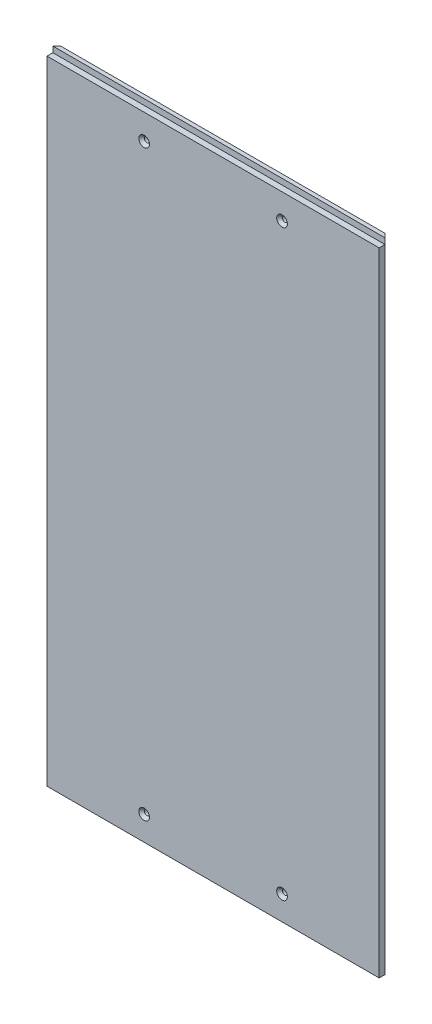
ISO-10303-21;
HEADER;
FILE_DESCRIPTION(('STEP AP214'),'2;1');
FILE_NAME('part.step','',(''),(''),'','','');
FILE_SCHEMA(('AUTOMOTIVE_DESIGN { 1 0 10303 214 1 1 1 1 }'));
ENDSEC;
DATA;
#1=APPLICATION_CONTEXT('core data for automotive mechanical design processes');
#2=APPLICATION_PROTOCOL_DEFINITION('international standard','automotive_design',2000,#1);
#3=PRODUCT_CONTEXT('',#1,'mechanical');
#4=PRODUCT('Part','Part','',(#3));
#5=PRODUCT_RELATED_PRODUCT_CATEGORY('part','',(#4));
#6=PRODUCT_DEFINITION_FORMATION('','',#4);
#7=PRODUCT_DEFINITION_CONTEXT('part definition',#1,'design');
#8=PRODUCT_DEFINITION('design','',#6,#7);
#9=PRODUCT_DEFINITION_SHAPE('','',#8);
#10=(LENGTH_UNIT() NAMED_UNIT(*) SI_UNIT(.MILLI.,.METRE.));
#11=(NAMED_UNIT(*) PLANE_ANGLE_UNIT() SI_UNIT($,.RADIAN.));
#12=(NAMED_UNIT(*) SI_UNIT($,.STERADIAN.) SOLID_ANGLE_UNIT());
#13=UNCERTAINTY_MEASURE_WITH_UNIT(LENGTH_MEASURE(1.E-05),#10,'distance_accuracy_value','');
#14=(GEOMETRIC_REPRESENTATION_CONTEXT(3) GLOBAL_UNCERTAINTY_ASSIGNED_CONTEXT((#13)) GLOBAL_UNIT_ASSIGNED_CONTEXT((#10,
#11,#12)) REPRESENTATION_CONTEXT('',''));
#15=CARTESIAN_POINT('',(0.,0.,0.));
#16=DIRECTION('',(0.,0.,1.));
#17=DIRECTION('',(1.,0.,0.));
#18=AXIS2_PLACEMENT_3D('',#15,#16,#17);
#19=CARTESIAN_POINT('',(-171.,328.5,12.));
#20=DIRECTION('',(0.,-1.,0.));
#21=DIRECTION('',(0.,0.,-1.));
#22=AXIS2_PLACEMENT_3D('',#19,#20,#21);
#23=PLANE('',#22);
#24=DIRECTION('',(1.,0.,0.));
#25=VECTOR('',#24,1.);
#26=CARTESIAN_POINT('',(-171.,328.5,2.));
#27=LINE('',#26,#25);
#28=CARTESIAN_POINT('',(-167.,328.5,2.));
#29=VERTEX_POINT('',#28);
#30=CARTESIAN_POINT('',(167.,328.5,2.));
#31=VERTEX_POINT('',#30);
#32=EDGE_CURVE('E163',#29,#31,#27,.T.);
#33=ORIENTED_EDGE('',*,*,#32,.F.);
#34=DIRECTION('',(-0.707106781186548,0.,0.707106781186548));
#35=VECTOR('',#34,1.);
#36=CARTESIAN_POINT('',(-171.,328.5,6.00000000000001));
#37=LINE('',#36,#35);
#38=CARTESIAN_POINT('',(-171.,328.5,6.));
#39=VERTEX_POINT('',#38);
#40=EDGE_CURVE('E241',#29,#39,#37,.T.);
#41=ORIENTED_EDGE('',*,*,#40,.T.);
#42=DIRECTION('',(-1.,0.,0.));
#43=VECTOR('',#42,1.);
#44=CARTESIAN_POINT('',(171.,328.5,6.));
#45=LINE('',#44,#43);
#46=CARTESIAN_POINT('',(171.,328.5,6.));
#47=VERTEX_POINT('',#46);
#48=EDGE_CURVE('E212',#47,#39,#45,.T.);
#49=ORIENTED_EDGE('',*,*,#48,.F.);
#50=DIRECTION('',(-0.707106781186548,0.,-0.707106781186548));
#51=VECTOR('',#50,1.);
#52=CARTESIAN_POINT('',(171.,328.5,6.00000000000001));
#53=LINE('',#52,#51);
#54=EDGE_CURVE('E132',#47,#31,#53,.T.);
#55=ORIENTED_EDGE('',*,*,#54,.T.);
#56=EDGE_LOOP('',(#33,#41,#49,#55));
#57=FACE_BOUND('',#56,.T.);
#58=ADVANCED_FACE('F34',(#57),#23,.F.);
#59=CARTESIAN_POINT('',(-71.,296.5,12.));
#60=DIRECTION('',(0.,0.,-1.));
#61=DIRECTION('',(-1.,0.,0.));
#62=AXIS2_PLACEMENT_3D('',#59,#60,#61);
#63=CYLINDRICAL_SURFACE('',#62,2.60000000000001);
#64=CARTESIAN_POINT('',(-71.,296.5,9.09999999999997));
#65=DIRECTION('',(0.,0.,-1.));
#66=DIRECTION('',(-1.,0.,0.));
#67=AXIS2_PLACEMENT_3D('',#64,#65,#66);
#68=CIRCLE('',#67,2.60000000000001);
#69=CARTESIAN_POINT('',(-73.6,296.5,9.09999999999997));
#70=VERTEX_POINT('',#69);
#71=EDGE_CURVE('E42',#70,#70,#68,.F.);
#72=ORIENTED_EDGE('',*,*,#71,.T.);
#73=EDGE_LOOP('',(#72));
#74=FACE_BOUND('',#73,.T.);
#75=CARTESIAN_POINT('',(-71.,296.5,2.));
#76=DIRECTION('',(0.,0.,-1.));
#77=DIRECTION('',(-1.,0.,0.));
#78=AXIS2_PLACEMENT_3D('',#75,#76,#77);
#79=CIRCLE('',#78,2.60000000000001);
#80=CARTESIAN_POINT('',(-73.6,296.5,2.));
#81=VERTEX_POINT('',#80);
#82=EDGE_CURVE('E181',#81,#81,#79,.F.);
#83=ORIENTED_EDGE('',*,*,#82,.F.);
#84=EDGE_LOOP('',(#83));
#85=FACE_BOUND('',#84,.T.);
#86=ADVANCED_FACE('F258',(#74,#85),#63,.F.);
#87=CARTESIAN_POINT('',(71.,296.5,12.));
#88=DIRECTION('',(0.,0.,-1.));
#89=DIRECTION('',(-1.,0.,0.));
#90=AXIS2_PLACEMENT_3D('',#87,#88,#89);
#91=CYLINDRICAL_SURFACE('',#90,2.60000000000001);
#92=CARTESIAN_POINT('',(71.,296.5,9.09999999999997));
#93=DIRECTION('',(0.,0.,-1.));
#94=DIRECTION('',(-1.,0.,0.));
#95=AXIS2_PLACEMENT_3D('',#92,#93,#94);
#96=CIRCLE('',#95,2.60000000000001);
#97=CARTESIAN_POINT('',(68.4,296.5,9.09999999999997));
#98=VERTEX_POINT('',#97);
#99=EDGE_CURVE('E156',#98,#98,#96,.F.);
#100=ORIENTED_EDGE('',*,*,#99,.T.);
#101=EDGE_LOOP('',(#100));
#102=FACE_BOUND('',#101,.T.);
#103=CARTESIAN_POINT('',(71.,296.5,2.));
#104=DIRECTION('',(0.,0.,-1.));
#105=DIRECTION('',(-1.,0.,0.));
#106=AXIS2_PLACEMENT_3D('',#103,#104,#105);
#107=CIRCLE('',#106,2.60000000000001);
#108=CARTESIAN_POINT('',(68.4,296.5,2.));
#109=VERTEX_POINT('',#108);
#110=EDGE_CURVE('E178',#109,#109,#107,.F.);
#111=ORIENTED_EDGE('',*,*,#110,.F.);
#112=EDGE_LOOP('',(#111));
#113=FACE_BOUND('',#112,.T.);
#114=ADVANCED_FACE('F260',(#102,#113),#91,.F.);
#115=CARTESIAN_POINT('',(171.,-328.5,12.));
#116=DIRECTION('',(-1.,0.,0.));
#117=DIRECTION('',(0.,0.,1.));
#118=AXIS2_PLACEMENT_3D('',#115,#116,#117);
#119=PLANE('',#118);
#120=DIRECTION('',(0.,0.,-1.));
#121=VECTOR('',#120,1.);
#122=CARTESIAN_POINT('',(171.,-328.5,12.));
#123=LINE('',#122,#121);
#124=CARTESIAN_POINT('',(171.,-328.5,12.));
#125=VERTEX_POINT('',#124);
#126=CARTESIAN_POINT('',(171.,-328.5,6.00000000000001));
#127=VERTEX_POINT('',#126);
#128=EDGE_CURVE('E232',#125,#127,#123,.T.);
#129=ORIENTED_EDGE('',*,*,#128,.T.);
#130=DIRECTION('',(0.,1.,0.));
#131=VECTOR('',#130,1.);
#132=CARTESIAN_POINT('',(171.,328.5,6.00000000000001));
#133=LINE('',#132,#131);
#134=CARTESIAN_POINT('',(171.,322.5,6.));
#135=VERTEX_POINT('',#134);
#136=EDGE_CURVE('E238',#127,#135,#133,.T.);
#137=ORIENTED_EDGE('',*,*,#136,.T.);
#138=DIRECTION('',(0.,0.,1.));
#139=VECTOR('',#138,1.);
#140=CARTESIAN_POINT('',(171.,322.5,12.));
#141=LINE('',#140,#139);
#142=CARTESIAN_POINT('',(171.,322.5,12.));
#143=VERTEX_POINT('',#142);
#144=EDGE_CURVE('E208',#135,#143,#141,.T.);
#145=ORIENTED_EDGE('',*,*,#144,.T.);
#146=DIRECTION('',(0.,1.,0.));
#147=VECTOR('',#146,1.);
#148=CARTESIAN_POINT('',(171.,-328.5,12.));
#149=LINE('',#148,#147);
#150=EDGE_CURVE('E225',#125,#143,#149,.T.);
#151=ORIENTED_EDGE('',*,*,#150,.F.);
#152=EDGE_LOOP('',(#129,#137,#145,#151));
#153=FACE_BOUND('',#152,.T.);
#154=ADVANCED_FACE('F267',(#153),#119,.F.);
#155=CARTESIAN_POINT('',(-171.,-328.5,12.));
#156=DIRECTION('',(1.,0.,0.));
#157=DIRECTION('',(0.,0.,-1.));
#158=AXIS2_PLACEMENT_3D('',#155,#156,#157);
#159=PLANE('',#158);
#160=DIRECTION('',(0.,0.,1.));
#161=VECTOR('',#160,1.);
#162=CARTESIAN_POINT('',(-171.,322.5,12.));
#163=LINE('',#162,#161);
#164=CARTESIAN_POINT('',(-171.,322.5,6.));
#165=VERTEX_POINT('',#164);
#166=CARTESIAN_POINT('',(-171.,322.5,12.));
#167=VERTEX_POINT('',#166);
#168=EDGE_CURVE('E209',#165,#167,#163,.T.);
#169=ORIENTED_EDGE('',*,*,#168,.F.);
#170=DIRECTION('',(0.,-1.,0.));
#171=VECTOR('',#170,1.);
#172=CARTESIAN_POINT('',(-171.,-328.5,6.00000000000001));
#173=LINE('',#172,#171);
#174=CARTESIAN_POINT('',(-171.,-328.5,6.00000000000001));
#175=VERTEX_POINT('',#174);
#176=EDGE_CURVE('E56',#165,#175,#173,.T.);
#177=ORIENTED_EDGE('',*,*,#176,.T.);
#178=DIRECTION('',(0.,0.,-1.));
#179=VECTOR('',#178,1.);
#180=CARTESIAN_POINT('',(-171.,-328.5,12.));
#181=LINE('',#180,#179);
#182=CARTESIAN_POINT('',(-171.,-328.5,12.));
#183=VERTEX_POINT('',#182);
#184=EDGE_CURVE('E236',#183,#175,#181,.T.);
#185=ORIENTED_EDGE('',*,*,#184,.F.);
#186=DIRECTION('',(0.,-1.,0.));
#187=VECTOR('',#186,1.);
#188=CARTESIAN_POINT('',(-171.,-328.5,12.));
#189=LINE('',#188,#187);
#190=EDGE_CURVE('E228',#167,#183,#189,.T.);
#191=ORIENTED_EDGE('',*,*,#190,.F.);
#192=EDGE_LOOP('',(#169,#177,#185,#191));
#193=FACE_BOUND('',#192,.T.);
#194=ADVANCED_FACE('F300',(#193),#159,.F.);
#195=CARTESIAN_POINT('',(-171.,-328.5,12.));
#196=DIRECTION('',(0.,1.,0.));
#197=DIRECTION('',(0.,0.,1.));
#198=AXIS2_PLACEMENT_3D('',#195,#196,#197);
#199=PLANE('',#198);
#200=DIRECTION('',(1.,0.,0.));
#201=VECTOR('',#200,1.);
#202=CARTESIAN_POINT('',(-171.,-328.5,0.));
#203=LINE('',#202,#201);
#204=CARTESIAN_POINT('',(-165.,-328.5,0.));
#205=VERTEX_POINT('',#204);
#206=CARTESIAN_POINT('',(165.,-328.5,0.));
#207=VERTEX_POINT('',#206);
#208=EDGE_CURVE('E219',#205,#207,#203,.T.);
#209=ORIENTED_EDGE('',*,*,#208,.T.);
#210=DIRECTION('',(0.707106781186548,0.,0.707106781186548));
#211=VECTOR('',#210,1.);
#212=CARTESIAN_POINT('',(171.,-328.5,6.00000000000001));
#213=LINE('',#212,#211);
#214=EDGE_CURVE('E128',#207,#127,#213,.T.);
#215=ORIENTED_EDGE('',*,*,#214,.T.);
#216=ORIENTED_EDGE('',*,*,#128,.F.);
#217=DIRECTION('',(1.,0.,0.));
#218=VECTOR('',#217,1.);
#219=CARTESIAN_POINT('',(-171.,-328.5,12.));
#220=LINE('',#219,#218);
#221=EDGE_CURVE('E230',#183,#125,#220,.T.);
#222=ORIENTED_EDGE('',*,*,#221,.F.);
#223=ORIENTED_EDGE('',*,*,#184,.T.);
#224=DIRECTION('',(0.707106781186548,0.,-0.707106781186548));
#225=VECTOR('',#224,1.);
#226=CARTESIAN_POINT('',(-171.,-328.5,6.00000000000001));
#227=LINE('',#226,#225);
#228=EDGE_CURVE('E129',#175,#205,#227,.T.);
#229=ORIENTED_EDGE('',*,*,#228,.T.);
#230=EDGE_LOOP('',(#209,#215,#216,#222,#223,#229));
#231=FACE_BOUND('',#230,.T.);
#232=ADVANCED_FACE('F294',(#231),#199,.F.);
#233=CARTESIAN_POINT('',(0.,0.,12.));
#234=DIRECTION('',(0.,0.,-1.));
#235=DIRECTION('',(-1.,0.,0.));
#236=AXIS2_PLACEMENT_3D('',#233,#234,#235);
#237=PLANE('',#236);
#238=CARTESIAN_POINT('',(-71.,-303.5,12.));
#239=DIRECTION('',(0.,0.,-1.));
#240=DIRECTION('',(-1.,0.,0.));
#241=AXIS2_PLACEMENT_3D('',#238,#239,#240);
#242=CIRCLE('',#241,5.50000000000006);
#243=CARTESIAN_POINT('',(-76.5,-303.5,12.));
#244=VERTEX_POINT('',#243);
#245=EDGE_CURVE('E147',#244,#244,#242,.T.);
#246=ORIENTED_EDGE('',*,*,#245,.T.);
#247=EDGE_LOOP('',(#246));
#248=FACE_BOUND('',#247,.T.);
#249=CARTESIAN_POINT('',(71.,-303.5,12.));
#250=DIRECTION('',(0.,0.,-1.));
#251=DIRECTION('',(-1.,0.,0.));
#252=AXIS2_PLACEMENT_3D('',#249,#250,#251);
#253=CIRCLE('',#252,5.50000000000006);
#254=CARTESIAN_POINT('',(65.5,-303.5,12.));
#255=VERTEX_POINT('',#254);
#256=EDGE_CURVE('E144',#255,#255,#253,.T.);
#257=ORIENTED_EDGE('',*,*,#256,.T.);
#258=EDGE_LOOP('',(#257));
#259=FACE_BOUND('',#258,.T.);
#260=CARTESIAN_POINT('',(71.,296.5,12.));
#261=DIRECTION('',(0.,0.,-1.));
#262=DIRECTION('',(-1.,0.,0.));
#263=AXIS2_PLACEMENT_3D('',#260,#261,#262);
#264=CIRCLE('',#263,5.50000000000006);
#265=CARTESIAN_POINT('',(65.5,296.5,12.));
#266=VERTEX_POINT('',#265);
#267=EDGE_CURVE('E141',#266,#266,#264,.T.);
#268=ORIENTED_EDGE('',*,*,#267,.T.);
#269=EDGE_LOOP('',(#268));
#270=FACE_BOUND('',#269,.T.);
#271=CARTESIAN_POINT('',(-71.,296.5,12.));
#272=DIRECTION('',(0.,0.,-1.));
#273=DIRECTION('',(-1.,0.,0.));
#274=AXIS2_PLACEMENT_3D('',#271,#272,#273);
#275=CIRCLE('',#274,5.50000000000006);
#276=CARTESIAN_POINT('',(-76.5,296.5,12.));
#277=VERTEX_POINT('',#276);
#278=EDGE_CURVE('E138',#277,#277,#275,.T.);
#279=ORIENTED_EDGE('',*,*,#278,.T.);
#280=EDGE_LOOP('',(#279));
#281=FACE_BOUND('',#280,.T.);
#282=ORIENTED_EDGE('',*,*,#150,.T.);
#283=DIRECTION('',(-1.,0.,0.));
#284=VECTOR('',#283,1.);
#285=CARTESIAN_POINT('',(171.,322.5,12.));
#286=LINE('',#285,#284);
#287=EDGE_CURVE('E216',#143,#167,#286,.T.);
#288=ORIENTED_EDGE('',*,*,#287,.T.);
#289=ORIENTED_EDGE('',*,*,#190,.T.);
#290=ORIENTED_EDGE('',*,*,#221,.T.);
#291=EDGE_LOOP('',(#282,#288,#289,#290));
#292=FACE_BOUND('',#291,.T.);
#293=ADVANCED_FACE('F291',(#248,#259,#270,#281,#292),#237,.F.);
#294=CARTESIAN_POINT('',(0.,0.,0.));
#295=DIRECTION('',(0.,0.,-1.));
#296=DIRECTION('',(-1.,0.,0.));
#297=AXIS2_PLACEMENT_3D('',#294,#295,#296);
#298=PLANE('',#297);
#299=DIRECTION('',(-1.,0.,0.));
#300=VECTOR('',#299,1.);
#301=CARTESIAN_POINT('',(171.,280.5,0.));
#302=LINE('',#301,#300);
#303=CARTESIAN_POINT('',(165.,280.5,0.));
#304=VERTEX_POINT('',#303);
#305=CARTESIAN_POINT('',(-165.,280.5,0.));
#306=VERTEX_POINT('',#305);
#307=EDGE_CURVE('E107',#304,#306,#302,.T.);
#308=ORIENTED_EDGE('',*,*,#307,.F.);
#309=DIRECTION('',(0.,-1.,0.));
#310=VECTOR('',#309,1.);
#311=CARTESIAN_POINT('',(165.,-328.5,0.));
#312=LINE('',#311,#310);
#313=EDGE_CURVE('E120',#304,#207,#312,.T.);
#314=ORIENTED_EDGE('',*,*,#313,.T.);
#315=ORIENTED_EDGE('',*,*,#208,.F.);
#316=DIRECTION('',(0.,1.,0.));
#317=VECTOR('',#316,1.);
#318=CARTESIAN_POINT('',(-165.,328.5,0.));
#319=LINE('',#318,#317);
#320=EDGE_CURVE('E123',#205,#306,#319,.T.);
#321=ORIENTED_EDGE('',*,*,#320,.T.);
#322=EDGE_LOOP('',(#308,#314,#315,#321));
#323=FACE_BOUND('',#322,.T.);
#324=CARTESIAN_POINT('',(-71.,-303.5,0.));
#325=DIRECTION('',(0.,0.,-1.));
#326=DIRECTION('',(-1.,0.,0.));
#327=AXIS2_PLACEMENT_3D('',#324,#325,#326);
#328=CIRCLE('',#327,2.60000000000001);
#329=CARTESIAN_POINT('',(-73.6,-303.5,0.));
#330=VERTEX_POINT('',#329);
#331=EDGE_CURVE('E199',#330,#330,#328,.T.);
#332=ORIENTED_EDGE('',*,*,#331,.F.);
#333=EDGE_LOOP('',(#332));
#334=FACE_BOUND('',#333,.T.);
#335=CARTESIAN_POINT('',(71.,-303.5,0.));
#336=DIRECTION('',(0.,0.,-1.));
#337=DIRECTION('',(-1.,0.,0.));
#338=AXIS2_PLACEMENT_3D('',#335,#336,#337);
#339=CIRCLE('',#338,2.60000000000001);
#340=CARTESIAN_POINT('',(68.4,-303.5,0.));
#341=VERTEX_POINT('',#340);
#342=EDGE_CURVE('E202',#341,#341,#339,.T.);
#343=ORIENTED_EDGE('',*,*,#342,.F.);
#344=EDGE_LOOP('',(#343));
#345=FACE_BOUND('',#344,.T.);
#346=ADVANCED_FACE('F117',(#323,#334,#345),#298,.T.);
#347=CARTESIAN_POINT('',(171.,322.5,12.));
#348=DIRECTION('',(0.,-1.,0.));
#349=DIRECTION('',(0.,0.,-1.));
#350=AXIS2_PLACEMENT_3D('',#347,#348,#349);
#351=PLANE('',#350);
#352=ORIENTED_EDGE('',*,*,#168,.T.);
#353=ORIENTED_EDGE('',*,*,#287,.F.);
#354=ORIENTED_EDGE('',*,*,#144,.F.);
#355=DIRECTION('',(-1.,0.,0.));
#356=VECTOR('',#355,1.);
#357=CARTESIAN_POINT('',(171.,322.5,6.));
#358=LINE('',#357,#356);
#359=EDGE_CURVE('E220',#135,#165,#358,.T.);
#360=ORIENTED_EDGE('',*,*,#359,.T.);
#361=EDGE_LOOP('',(#352,#353,#354,#360));
#362=FACE_BOUND('',#361,.T.);
#363=ADVANCED_FACE('F283',(#362),#351,.F.);
#364=CARTESIAN_POINT('',(171.,328.5,6.));
#365=DIRECTION('',(0.,0.,-1.));
#366=DIRECTION('',(0.,1.,0.));
#367=AXIS2_PLACEMENT_3D('',#364,#365,#366);
#368=PLANE('',#367);
#369=DIRECTION('',(0.,-1.,0.));
#370=VECTOR('',#369,1.);
#371=CARTESIAN_POINT('',(-171.,328.5,6.));
#372=LINE('',#371,#370);
#373=EDGE_CURVE('E205',#39,#165,#372,.T.);
#374=ORIENTED_EDGE('',*,*,#373,.T.);
#375=ORIENTED_EDGE('',*,*,#359,.F.);
#376=DIRECTION('',(0.,-1.,0.));
#377=VECTOR('',#376,1.);
#378=CARTESIAN_POINT('',(171.,328.5,6.));
#379=LINE('',#378,#377);
#380=EDGE_CURVE('E206',#47,#135,#379,.T.);
#381=ORIENTED_EDGE('',*,*,#380,.F.);
#382=ORIENTED_EDGE('',*,*,#48,.T.);
#383=EDGE_LOOP('',(#374,#375,#381,#382));
#384=FACE_BOUND('',#383,.T.);
#385=ADVANCED_FACE('F286',(#384),#368,.F.);
#386=CARTESIAN_POINT('',(171.,-328.5,6.00000000000001));
#387=DIRECTION('',(0.707106781186547,0.,-0.707106781186547));
#388=DIRECTION('',(0.,-1.,0.));
#389=AXIS2_PLACEMENT_3D('',#386,#387,#388);
#390=PLANE('',#389);
#391=DIRECTION('',(-0.707106781186548,0.,-0.707106781186548));
#392=VECTOR('',#391,1.);
#393=CARTESIAN_POINT('',(171.,280.5,6.00000000000001));
#394=LINE('',#393,#392);
#395=CARTESIAN_POINT('',(167.,280.5,2.));
#396=VERTEX_POINT('',#395);
#397=EDGE_CURVE('E104',#396,#304,#394,.T.);
#398=ORIENTED_EDGE('',*,*,#397,.F.);
#399=DIRECTION('',(0.,1.,0.));
#400=VECTOR('',#399,1.);
#401=CARTESIAN_POINT('',(167.,-328.5,2.));
#402=LINE('',#401,#400);
#403=EDGE_CURVE('E113',#396,#31,#402,.T.);
#404=ORIENTED_EDGE('',*,*,#403,.T.);
#405=ORIENTED_EDGE('',*,*,#54,.F.);
#406=ORIENTED_EDGE('',*,*,#380,.T.);
#407=ORIENTED_EDGE('',*,*,#136,.F.);
#408=ORIENTED_EDGE('',*,*,#214,.F.);
#409=ORIENTED_EDGE('',*,*,#313,.F.);
#410=EDGE_LOOP('',(#398,#404,#405,#406,#407,#408,#409));
#411=FACE_BOUND('',#410,.T.);
#412=ADVANCED_FACE('F126',(#411),#390,.T.);
#413=CARTESIAN_POINT('',(-171.,-328.5,6.00000000000001));
#414=DIRECTION('',(-0.707106781186547,0.,-0.707106781186547));
#415=DIRECTION('',(0.,1.,0.));
#416=AXIS2_PLACEMENT_3D('',#413,#414,#415);
#417=PLANE('',#416);
#418=DIRECTION('',(-0.707106781186548,0.,0.707106781186548));
#419=VECTOR('',#418,1.);
#420=CARTESIAN_POINT('',(-171.,280.5,6.00000000000001));
#421=LINE('',#420,#419);
#422=CARTESIAN_POINT('',(-167.,280.5,2.));
#423=VERTEX_POINT('',#422);
#424=EDGE_CURVE('E11',#306,#423,#421,.T.);
#425=ORIENTED_EDGE('',*,*,#424,.F.);
#426=ORIENTED_EDGE('',*,*,#320,.F.);
#427=ORIENTED_EDGE('',*,*,#228,.F.);
#428=ORIENTED_EDGE('',*,*,#176,.F.);
#429=ORIENTED_EDGE('',*,*,#373,.F.);
#430=ORIENTED_EDGE('',*,*,#40,.F.);
#431=DIRECTION('',(0.,-1.,0.));
#432=VECTOR('',#431,1.);
#433=CARTESIAN_POINT('',(-167.,-328.5,2.));
#434=LINE('',#433,#432);
#435=EDGE_CURVE('E184',#29,#423,#434,.T.);
#436=ORIENTED_EDGE('',*,*,#435,.T.);
#437=EDGE_LOOP('',(#425,#426,#427,#428,#429,#430,#436));
#438=FACE_BOUND('',#437,.T.);
#439=ADVANCED_FACE('F281',(#438),#417,.T.);
#440=CARTESIAN_POINT('',(71.,-303.5,12.));
#441=DIRECTION('',(0.,0.,-1.));
#442=DIRECTION('',(-1.,0.,0.));
#443=AXIS2_PLACEMENT_3D('',#440,#441,#442);
#444=CYLINDRICAL_SURFACE('',#443,2.60000000000001);
#445=CARTESIAN_POINT('',(71.,-303.5,9.09999999999997));
#446=DIRECTION('',(0.,0.,-1.));
#447=DIRECTION('',(-1.,0.,0.));
#448=AXIS2_PLACEMENT_3D('',#445,#446,#447);
#449=CIRCLE('',#448,2.60000000000001);
#450=CARTESIAN_POINT('',(68.4,-303.5,9.09999999999997));
#451=VERTEX_POINT('',#450);
#452=EDGE_CURVE('E153',#451,#451,#449,.F.);
#453=ORIENTED_EDGE('',*,*,#452,.T.);
#454=EDGE_LOOP('',(#453));
#455=FACE_BOUND('',#454,.T.);
#456=ORIENTED_EDGE('',*,*,#342,.T.);
#457=EDGE_LOOP('',(#456));
#458=FACE_BOUND('',#457,.T.);
#459=ADVANCED_FACE('F277',(#455,#458),#444,.F.);
#460=CARTESIAN_POINT('',(-71.,-303.5,12.));
#461=DIRECTION('',(0.,0.,-1.));
#462=DIRECTION('',(-1.,0.,0.));
#463=AXIS2_PLACEMENT_3D('',#460,#461,#462);
#464=CYLINDRICAL_SURFACE('',#463,2.60000000000001);
#465=CARTESIAN_POINT('',(-71.,-303.5,9.09999999999997));
#466=DIRECTION('',(0.,0.,-1.));
#467=DIRECTION('',(-1.,0.,0.));
#468=AXIS2_PLACEMENT_3D('',#465,#466,#467);
#469=CIRCLE('',#468,2.60000000000001);
#470=CARTESIAN_POINT('',(-73.6,-303.5,9.09999999999997));
#471=VERTEX_POINT('',#470);
#472=EDGE_CURVE('E150',#471,#471,#469,.F.);
#473=ORIENTED_EDGE('',*,*,#472,.T.);
#474=EDGE_LOOP('',(#473));
#475=FACE_BOUND('',#474,.T.);
#476=ORIENTED_EDGE('',*,*,#331,.T.);
#477=EDGE_LOOP('',(#476));
#478=FACE_BOUND('',#477,.T.);
#479=ADVANCED_FACE('F273',(#475,#478),#464,.F.);
#480=CARTESIAN_POINT('',(-71.,-303.5,12.));
#481=DIRECTION('',(0.,0.,1.));
#482=DIRECTION('',(1.,0.,0.));
#483=AXIS2_PLACEMENT_3D('',#480,#481,#482);
#484=CONICAL_SURFACE('',#483,5.50000000000006,0.785398163397451);
#485=ORIENTED_EDGE('',*,*,#472,.F.);
#486=EDGE_LOOP('',(#485));
#487=FACE_BOUND('',#486,.T.);
#488=ORIENTED_EDGE('',*,*,#245,.F.);
#489=EDGE_LOOP('',(#488));
#490=FACE_BOUND('',#489,.T.);
#491=ADVANCED_FACE('F276',(#487,#490),#484,.F.);
#492=CARTESIAN_POINT('',(71.,-303.5,12.));
#493=DIRECTION('',(0.,0.,1.));
#494=DIRECTION('',(1.,0.,0.));
#495=AXIS2_PLACEMENT_3D('',#492,#493,#494);
#496=CONICAL_SURFACE('',#495,5.50000000000006,0.785398163397451);
#497=ORIENTED_EDGE('',*,*,#452,.F.);
#498=EDGE_LOOP('',(#497));
#499=FACE_BOUND('',#498,.T.);
#500=ORIENTED_EDGE('',*,*,#256,.F.);
#501=EDGE_LOOP('',(#500));
#502=FACE_BOUND('',#501,.T.);
#503=ADVANCED_FACE('F314',(#499,#502),#496,.F.);
#504=CARTESIAN_POINT('',(71.,296.5,12.));
#505=DIRECTION('',(0.,0.,1.));
#506=DIRECTION('',(1.,0.,0.));
#507=AXIS2_PLACEMENT_3D('',#504,#505,#506);
#508=CONICAL_SURFACE('',#507,5.50000000000006,0.785398163397451);
#509=ORIENTED_EDGE('',*,*,#99,.F.);
#510=EDGE_LOOP('',(#509));
#511=FACE_BOUND('',#510,.T.);
#512=ORIENTED_EDGE('',*,*,#267,.F.);
#513=EDGE_LOOP('',(#512));
#514=FACE_BOUND('',#513,.T.);
#515=ADVANCED_FACE('F317',(#511,#514),#508,.F.);
#516=CARTESIAN_POINT('',(-71.,296.5,12.));
#517=DIRECTION('',(0.,0.,1.));
#518=DIRECTION('',(1.,0.,0.));
#519=AXIS2_PLACEMENT_3D('',#516,#517,#518);
#520=CONICAL_SURFACE('',#519,5.50000000000006,0.785398163397451);
#521=ORIENTED_EDGE('',*,*,#71,.F.);
#522=EDGE_LOOP('',(#521));
#523=FACE_BOUND('',#522,.T.);
#524=ORIENTED_EDGE('',*,*,#278,.F.);
#525=EDGE_LOOP('',(#524));
#526=FACE_BOUND('',#525,.T.);
#527=ADVANCED_FACE('F36',(#523,#526),#520,.F.);
#528=CARTESIAN_POINT('',(0.,0.,2.));
#529=DIRECTION('',(0.,0.,-1.));
#530=DIRECTION('',(-1.,0.,0.));
#531=AXIS2_PLACEMENT_3D('',#528,#529,#530);
#532=PLANE('',#531);
#533=ORIENTED_EDGE('',*,*,#110,.T.);
#534=EDGE_LOOP('',(#533));
#535=FACE_BOUND('',#534,.T.);
#536=CARTESIAN_POINT('',(51.,296.5,2.));
#537=DIRECTION('',(0.,0.,-1.));
#538=DIRECTION('',(-1.,0.,0.));
#539=AXIS2_PLACEMENT_3D('',#536,#537,#538);
#540=CIRCLE('',#539,5.99999999999999);
#541=CARTESIAN_POINT('',(45.,296.5,2.));
#542=VERTEX_POINT('',#541);
#543=EDGE_CURVE('E167',#542,#542,#540,.F.);
#544=ORIENTED_EDGE('',*,*,#543,.T.);
#545=EDGE_LOOP('',(#544));
#546=FACE_BOUND('',#545,.T.);
#547=CARTESIAN_POINT('',(-91.,296.5,2.));
#548=DIRECTION('',(0.,0.,-1.));
#549=DIRECTION('',(-1.,0.,0.));
#550=AXIS2_PLACEMENT_3D('',#547,#548,#549);
#551=CIRCLE('',#550,5.99999999999999);
#552=CARTESIAN_POINT('',(-97.,296.5,2.));
#553=VERTEX_POINT('',#552);
#554=EDGE_CURVE('E160',#553,#553,#551,.F.);
#555=ORIENTED_EDGE('',*,*,#554,.T.);
#556=EDGE_LOOP('',(#555));
#557=FACE_BOUND('',#556,.T.);
#558=DIRECTION('',(-1.,0.,0.));
#559=VECTOR('',#558,1.);
#560=CARTESIAN_POINT('',(171.,280.5,2.));
#561=LINE('',#560,#559);
#562=EDGE_CURVE('E49',#396,#423,#561,.T.);
#563=ORIENTED_EDGE('',*,*,#562,.T.);
#564=ORIENTED_EDGE('',*,*,#435,.F.);
#565=ORIENTED_EDGE('',*,*,#32,.T.);
#566=ORIENTED_EDGE('',*,*,#403,.F.);
#567=EDGE_LOOP('',(#563,#564,#565,#566));
#568=FACE_BOUND('',#567,.T.);
#569=CARTESIAN_POINT('',(-51.,296.5,2.));
#570=DIRECTION('',(0.,0.,-1.));
#571=DIRECTION('',(-1.,0.,0.));
#572=AXIS2_PLACEMENT_3D('',#569,#570,#571);
#573=CIRCLE('',#572,5.99999999999999);
#574=CARTESIAN_POINT('',(-57.,296.5,2.));
#575=VERTEX_POINT('',#574);
#576=EDGE_CURVE('E162',#575,#575,#573,.F.);
#577=ORIENTED_EDGE('',*,*,#576,.T.);
#578=EDGE_LOOP('',(#577));
#579=FACE_BOUND('',#578,.T.);
#580=CARTESIAN_POINT('',(91.,296.5,2.));
#581=DIRECTION('',(0.,0.,-1.));
#582=DIRECTION('',(-1.,0.,0.));
#583=AXIS2_PLACEMENT_3D('',#580,#581,#582);
#584=CIRCLE('',#583,5.99999999999999);
#585=CARTESIAN_POINT('',(85.,296.5,2.));
#586=VERTEX_POINT('',#585);
#587=EDGE_CURVE('E175',#586,#586,#584,.F.);
#588=ORIENTED_EDGE('',*,*,#587,.T.);
#589=EDGE_LOOP('',(#588));
#590=FACE_BOUND('',#589,.T.);
#591=ORIENTED_EDGE('',*,*,#82,.T.);
#592=EDGE_LOOP('',(#591));
#593=FACE_BOUND('',#592,.T.);
#594=ADVANCED_FACE('F247',(#535,#546,#557,#568,#579,#590,#593),#532,.T.);
#595=CARTESIAN_POINT('',(171.,280.5,2.));
#596=DIRECTION('',(0.,-1.,0.));
#597=DIRECTION('',(0.,0.,-1.));
#598=AXIS2_PLACEMENT_3D('',#595,#596,#597);
#599=PLANE('',#598);
#600=ORIENTED_EDGE('',*,*,#397,.T.);
#601=ORIENTED_EDGE('',*,*,#307,.T.);
#602=ORIENTED_EDGE('',*,*,#424,.T.);
#603=ORIENTED_EDGE('',*,*,#562,.F.);
#604=EDGE_LOOP('',(#600,#601,#602,#603));
#605=FACE_BOUND('',#604,.T.);
#606=ADVANCED_FACE('F106',(#605),#599,.F.);
#607=CARTESIAN_POINT('',(-51.,296.5,6.));
#608=DIRECTION('',(0.,0.,-1.));
#609=DIRECTION('',(-1.,0.,0.));
#610=AXIS2_PLACEMENT_3D('',#607,#608,#609);
#611=PLANE('',#610);
#612=CARTESIAN_POINT('',(-51.,296.5,6.));
#613=DIRECTION('',(0.,0.,-1.));
#614=DIRECTION('',(-1.,0.,0.));
#615=AXIS2_PLACEMENT_3D('',#612,#613,#614);
#616=CIRCLE('',#615,5.99999999999999);
#617=CARTESIAN_POINT('',(-57.,296.5,6.));
#618=VERTEX_POINT('',#617);
#619=EDGE_CURVE('E190',#618,#618,#616,.T.);
#620=ORIENTED_EDGE('',*,*,#619,.T.);
#621=EDGE_LOOP('',(#620));
#622=FACE_BOUND('',#621,.T.);
#623=ADVANCED_FACE('F382',(#622),#611,.T.);
#624=CARTESIAN_POINT('',(-51.,296.5,6.));
#625=DIRECTION('',(0.,0.,-1.));
#626=DIRECTION('',(-1.,0.,0.));
#627=AXIS2_PLACEMENT_3D('',#624,#625,#626);
#628=CYLINDRICAL_SURFACE('',#627,5.99999999999999);
#629=ORIENTED_EDGE('',*,*,#619,.F.);
#630=EDGE_LOOP('',(#629));
#631=FACE_BOUND('',#630,.T.);
#632=ORIENTED_EDGE('',*,*,#576,.F.);
#633=EDGE_LOOP('',(#632));
#634=FACE_BOUND('',#633,.T.);
#635=ADVANCED_FACE('F359',(#631,#634),#628,.F.);
#636=CARTESIAN_POINT('',(51.,296.5,6.));
#637=DIRECTION('',(0.,0.,-1.));
#638=DIRECTION('',(-1.,0.,0.));
#639=AXIS2_PLACEMENT_3D('',#636,#637,#638);
#640=PLANE('',#639);
#641=CARTESIAN_POINT('',(51.,296.5,6.));
#642=DIRECTION('',(0.,0.,-1.));
#643=DIRECTION('',(-1.,0.,0.));
#644=AXIS2_PLACEMENT_3D('',#641,#642,#643);
#645=CIRCLE('',#644,5.99999999999999);
#646=CARTESIAN_POINT('',(45.,296.5,6.));
#647=VERTEX_POINT('',#646);
#648=EDGE_CURVE('E193',#647,#647,#645,.T.);
#649=ORIENTED_EDGE('',*,*,#648,.T.);
#650=EDGE_LOOP('',(#649));
#651=FACE_BOUND('',#650,.T.);
#652=ADVANCED_FACE('F349',(#651),#640,.T.);
#653=CARTESIAN_POINT('',(51.,296.5,6.));
#654=DIRECTION('',(0.,0.,-1.));
#655=DIRECTION('',(-1.,0.,0.));
#656=AXIS2_PLACEMENT_3D('',#653,#654,#655);
#657=CYLINDRICAL_SURFACE('',#656,5.99999999999999);
#658=ORIENTED_EDGE('',*,*,#648,.F.);
#659=EDGE_LOOP('',(#658));
#660=FACE_BOUND('',#659,.T.);
#661=ORIENTED_EDGE('',*,*,#543,.F.);
#662=EDGE_LOOP('',(#661));
#663=FACE_BOUND('',#662,.T.);
#664=ADVANCED_FACE('F346',(#660,#663),#657,.F.);
#665=CARTESIAN_POINT('',(91.,296.5,6.));
#666=DIRECTION('',(0.,0.,-1.));
#667=DIRECTION('',(-1.,0.,0.));
#668=AXIS2_PLACEMENT_3D('',#665,#666,#667);
#669=PLANE('',#668);
#670=CARTESIAN_POINT('',(91.,296.5,6.));
#671=DIRECTION('',(0.,0.,-1.));
#672=DIRECTION('',(-1.,0.,0.));
#673=AXIS2_PLACEMENT_3D('',#670,#671,#672);
#674=CIRCLE('',#673,5.99999999999999);
#675=CARTESIAN_POINT('',(85.,296.5,6.));
#676=VERTEX_POINT('',#675);
#677=EDGE_CURVE('E196',#676,#676,#674,.T.);
#678=ORIENTED_EDGE('',*,*,#677,.T.);
#679=EDGE_LOOP('',(#678));
#680=FACE_BOUND('',#679,.T.);
#681=ADVANCED_FACE('F348',(#680),#669,.T.);
#682=CARTESIAN_POINT('',(91.,296.5,6.));
#683=DIRECTION('',(0.,0.,-1.));
#684=DIRECTION('',(-1.,0.,0.));
#685=AXIS2_PLACEMENT_3D('',#682,#683,#684);
#686=CYLINDRICAL_SURFACE('',#685,5.99999999999999);
#687=ORIENTED_EDGE('',*,*,#677,.F.);
#688=EDGE_LOOP('',(#687));
#689=FACE_BOUND('',#688,.T.);
#690=ORIENTED_EDGE('',*,*,#587,.F.);
#691=EDGE_LOOP('',(#690));
#692=FACE_BOUND('',#691,.T.);
#693=ADVANCED_FACE('F356',(#689,#692),#686,.F.);
#694=CARTESIAN_POINT('',(-91.,296.5,6.));
#695=DIRECTION('',(0.,0.,-1.));
#696=DIRECTION('',(-1.,0.,0.));
#697=AXIS2_PLACEMENT_3D('',#694,#695,#696);
#698=PLANE('',#697);
#699=CARTESIAN_POINT('',(-91.,296.5,6.));
#700=DIRECTION('',(0.,0.,-1.));
#701=DIRECTION('',(-1.,0.,0.));
#702=AXIS2_PLACEMENT_3D('',#699,#700,#701);
#703=CIRCLE('',#702,5.99999999999999);
#704=CARTESIAN_POINT('',(-97.,296.5,6.));
#705=VERTEX_POINT('',#704);
#706=EDGE_CURVE('E112',#705,#705,#703,.T.);
#707=ORIENTED_EDGE('',*,*,#706,.T.);
#708=EDGE_LOOP('',(#707));
#709=FACE_BOUND('',#708,.T.);
#710=ADVANCED_FACE('F365',(#709),#698,.T.);
#711=CARTESIAN_POINT('',(-91.,296.5,6.));
#712=DIRECTION('',(0.,0.,-1.));
#713=DIRECTION('',(-1.,0.,0.));
#714=AXIS2_PLACEMENT_3D('',#711,#712,#713);
#715=CYLINDRICAL_SURFACE('',#714,5.99999999999999);
#716=ORIENTED_EDGE('',*,*,#706,.F.);
#717=EDGE_LOOP('',(#716));
#718=FACE_BOUND('',#717,.T.);
#719=ORIENTED_EDGE('',*,*,#554,.F.);
#720=EDGE_LOOP('',(#719));
#721=FACE_BOUND('',#720,.T.);
#722=ADVANCED_FACE('F370',(#718,#721),#715,.F.);
#723=CLOSED_SHELL('',(#58,#86,#114,#154,#194,#232,#293,#346,#363,#385,#412,#439,#459,#479,#491,
#503,#515,#527,#594,#606,#623,#635,#652,#664,#681,#693,#710,#722));
#724=MANIFOLD_SOLID_BREP('B2',#723);
#725=ADVANCED_BREP_SHAPE_REPRESENTATION('',(#18,#724),#14);
#726=SHAPE_DEFINITION_REPRESENTATION(#9,#725);
ENDSEC;
END-ISO-10303-21;
